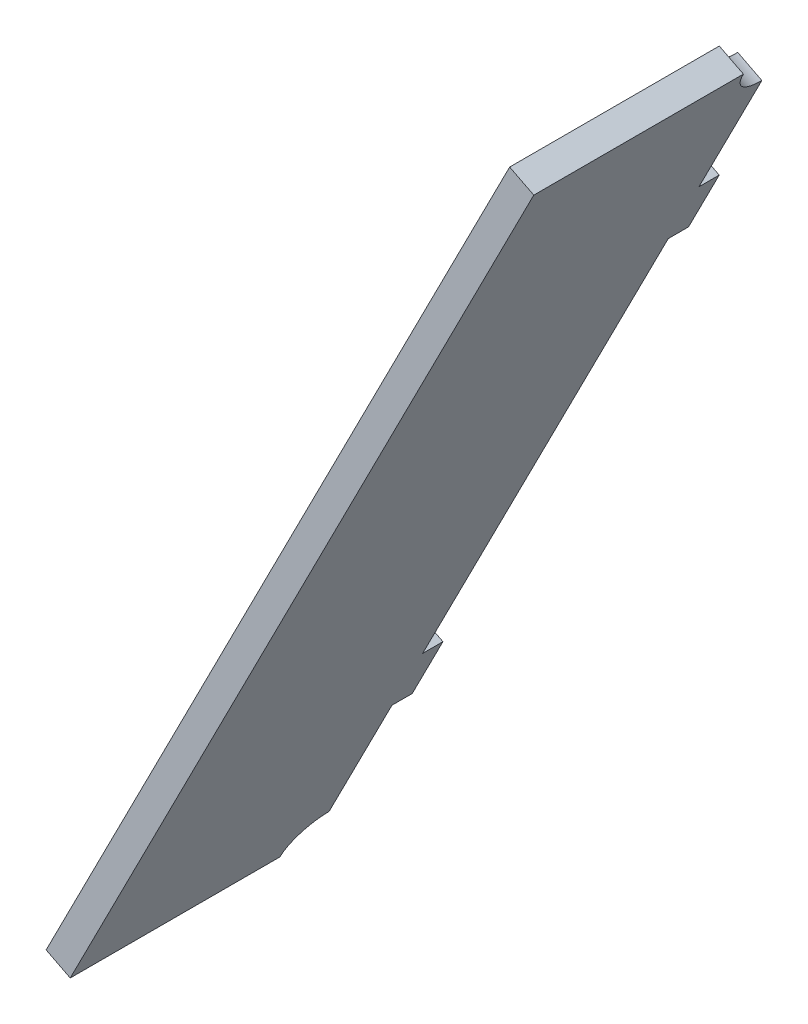
ISO-10303-21;
HEADER;
FILE_DESCRIPTION(('STEP AP214'),'2;1');
FILE_NAME('part.step','',(''),(''),'','','');
FILE_SCHEMA(('AUTOMOTIVE_DESIGN { 1 0 10303 214 1 1 1 1 }'));
ENDSEC;
DATA;
#1=APPLICATION_CONTEXT('core data for automotive mechanical design processes');
#2=APPLICATION_PROTOCOL_DEFINITION('international standard','automotive_design',2000,#1);
#3=PRODUCT_CONTEXT('',#1,'mechanical');
#4=PRODUCT('Part','Part','',(#3));
#5=PRODUCT_RELATED_PRODUCT_CATEGORY('part','',(#4));
#6=PRODUCT_DEFINITION_FORMATION('','',#4);
#7=PRODUCT_DEFINITION_CONTEXT('part definition',#1,'design');
#8=PRODUCT_DEFINITION('design','',#6,#7);
#9=PRODUCT_DEFINITION_SHAPE('','',#8);
#10=(LENGTH_UNIT() NAMED_UNIT(*) SI_UNIT(.MILLI.,.METRE.));
#11=(NAMED_UNIT(*) PLANE_ANGLE_UNIT() SI_UNIT($,.RADIAN.));
#12=(NAMED_UNIT(*) SI_UNIT($,.STERADIAN.) SOLID_ANGLE_UNIT());
#13=UNCERTAINTY_MEASURE_WITH_UNIT(LENGTH_MEASURE(1.E-05),#10,'distance_accuracy_value','');
#14=(GEOMETRIC_REPRESENTATION_CONTEXT(3) GLOBAL_UNCERTAINTY_ASSIGNED_CONTEXT((#13)) GLOBAL_UNIT_ASSIGNED_CONTEXT((#10,
#11,#12)) REPRESENTATION_CONTEXT('',''));
#15=CARTESIAN_POINT('',(0.,0.,0.));
#16=DIRECTION('',(0.,0.,1.));
#17=DIRECTION('',(1.,0.,0.));
#18=AXIS2_PLACEMENT_3D('',#15,#16,#17);
#19=CARTESIAN_POINT('',(1777.94361156912,3592.93720569683,-4.42342663159654E-11));
#20=DIRECTION('',(-0.453990499739547,-0.891006524188368,0.));
#21=DIRECTION('',(0.,0.,-1.));
#22=AXIS2_PLACEMENT_3D('',#19,#20,#21);
#23=PLANE('',#22);
#24=DIRECTION('',(-0.891006524188368,0.453990499739547,0.));
#25=VECTOR('',#24,1.);
#26=CARTESIAN_POINT('',(1777.94361156912,3592.93720569683,134.));
#27=LINE('',#26,#25);
#28=CARTESIAN_POINT('',(1781.50763766588,3591.12124369787,134.));
#29=VERTEX_POINT('',#28);
#30=CARTESIAN_POINT('',(1777.94361156912,3592.93720569683,134.));
#31=VERTEX_POINT('',#30);
#32=EDGE_CURVE('E11',#29,#31,#27,.T.);
#33=ORIENTED_EDGE('',*,*,#32,.F.);
#34=DIRECTION('',(0.,0.,1.));
#35=VECTOR('',#34,1.);
#36=CARTESIAN_POINT('',(1781.50763766588,3591.12124369787,-1.60698653736108E-13));
#37=LINE('',#36,#35);
#38=CARTESIAN_POINT('',(1781.50763766588,3591.12124369787,165.));
#39=VERTEX_POINT('',#38);
#40=EDGE_CURVE('E128',#39,#29,#37,.F.);
#41=ORIENTED_EDGE('',*,*,#40,.F.);
#42=DIRECTION('',(-0.891006524188368,0.453990499739547,0.));
#43=VECTOR('',#42,1.);
#44=CARTESIAN_POINT('',(1777.94361156912,3592.93720569683,165.));
#45=LINE('',#44,#43);
#46=CARTESIAN_POINT('',(1777.94361156912,3592.93720569683,165.));
#47=VERTEX_POINT('',#46);
#48=EDGE_CURVE('E53',#39,#47,#45,.T.);
#49=ORIENTED_EDGE('',*,*,#48,.T.);
#50=DIRECTION('',(0.,0.,-1.));
#51=VECTOR('',#50,1.);
#52=CARTESIAN_POINT('',(1777.94361156912,3592.93720569683,-4.42342663159654E-11));
#53=LINE('',#52,#51);
#54=EDGE_CURVE('E206',#47,#31,#53,.T.);
#55=ORIENTED_EDGE('',*,*,#54,.T.);
#56=EDGE_LOOP('',(#33,#41,#49,#55));
#57=FACE_BOUND('',#56,.T.);
#58=ADVANCED_FACE('F43',(#57),#23,.T.);
#59=CARTESIAN_POINT('',(-41.8773066368508,21.3375534877574,164.999999999999));
#60=DIRECTION('',(0.,0.,1.));
#61=DIRECTION('',(-0.453990499739547,-0.891006524188368,0.));
#62=AXIS2_PLACEMENT_3D('',#59,#60,#61);
#63=PLANE('',#62);
#64=ORIENTED_EDGE('',*,*,#48,.F.);
#65=DIRECTION('',(0.453990499739547,0.891006524188368,0.));
#66=VECTOR('',#65,1.);
#67=CARTESIAN_POINT('',(-38.3132805400973,19.5215914887992,165.));
#68=LINE('',#67,#66);
#69=CARTESIAN_POINT('',(1850.06020312655,3725.66322885032,165.));
#70=VERTEX_POINT('',#69);
#71=EDGE_CURVE('E165',#70,#39,#68,.F.);
#72=ORIENTED_EDGE('',*,*,#71,.F.);
#73=DIRECTION('',(-0.891006524188368,0.453990499739547,0.));
#74=VECTOR('',#73,1.);
#75=CARTESIAN_POINT('',(1846.4961770298,3727.47919084928,165.));
#76=LINE('',#75,#74);
#77=CARTESIAN_POINT('',(1846.4961770298,3727.47919084928,165.));
#78=VERTEX_POINT('',#77);
#79=EDGE_CURVE('E199',#70,#78,#76,.T.);
#80=ORIENTED_EDGE('',*,*,#79,.T.);
#81=DIRECTION('',(-0.453990499739547,-0.891006524188368,0.));
#82=VECTOR('',#81,1.);
#83=CARTESIAN_POINT('',(-41.8773066368508,21.3375534877574,164.999999999999));
#84=LINE('',#83,#82);
#85=EDGE_CURVE('E216',#78,#47,#84,.T.);
#86=ORIENTED_EDGE('',*,*,#85,.T.);
#87=EDGE_LOOP('',(#64,#72,#80,#86));
#88=FACE_BOUND('',#87,.T.);
#89=ADVANCED_FACE('F219',(#88),#63,.T.);
#90=CARTESIAN_POINT('',(1846.4961770298,3727.47919084927,-4.58939508681323E-11));
#91=DIRECTION('',(0.453990499739547,0.891006524188368,0.));
#92=DIRECTION('',(0.,0.,1.));
#93=AXIS2_PLACEMENT_3D('',#90,#91,#92);
#94=PLANE('',#93);
#95=ORIENTED_EDGE('',*,*,#79,.F.);
#96=DIRECTION('',(0.,0.,1.));
#97=VECTOR('',#96,1.);
#98=CARTESIAN_POINT('',(1850.06020312655,3725.66322885032,-1.60698653736108E-13));
#99=LINE('',#98,#97);
#100=CARTESIAN_POINT('',(1850.06020312655,3725.66322885032,134.));
#101=VERTEX_POINT('',#100);
#102=EDGE_CURVE('E162',#101,#70,#99,.T.);
#103=ORIENTED_EDGE('',*,*,#102,.F.);
#104=DIRECTION('',(-0.891006524188368,0.453990499739547,0.));
#105=VECTOR('',#104,1.);
#106=CARTESIAN_POINT('',(1846.4961770298,3727.47919084928,134.));
#107=LINE('',#106,#105);
#108=CARTESIAN_POINT('',(1846.4961770298,3727.47919084928,134.));
#109=VERTEX_POINT('',#108);
#110=EDGE_CURVE('E196',#101,#109,#107,.T.);
#111=ORIENTED_EDGE('',*,*,#110,.T.);
#112=DIRECTION('',(0.,0.,1.));
#113=VECTOR('',#112,1.);
#114=CARTESIAN_POINT('',(1846.4961770298,3727.47919084927,-4.58939508681323E-11));
#115=LINE('',#114,#113);
#116=EDGE_CURVE('E220',#109,#78,#115,.T.);
#117=ORIENTED_EDGE('',*,*,#116,.T.);
#118=EDGE_LOOP('',(#95,#103,#111,#117));
#119=FACE_BOUND('',#118,.T.);
#120=ADVANCED_FACE('F299',(#119),#94,.T.);
#121=CARTESIAN_POINT('',(1846.4961770298,3727.47919084928,129.));
#122=DIRECTION('',(0.891006524188368,-0.453990499739547,0.));
#123=DIRECTION('',(0.453990499739547,0.891006524188368,0.));
#124=AXIS2_PLACEMENT_3D('',#121,#122,#123);
#125=CYLINDRICAL_SURFACE('',#124,5.00000000000032);
#126=ORIENTED_EDGE('',*,*,#110,.F.);
#127=CARTESIAN_POINT('',(1850.06020312655,3725.66322885032,129.));
#128=DIRECTION('',(0.891006524188368,-0.453990499739547,0.));
#129=DIRECTION('',(0.453990499739547,0.891006524188368,0.));
#130=AXIS2_PLACEMENT_3D('',#127,#128,#129);
#131=CIRCLE('',#130,5.00000000000032);
#132=CARTESIAN_POINT('',(1847.79025062785,3721.20819622937,129.));
#133=VERTEX_POINT('',#132);
#134=EDGE_CURVE('E159',#133,#101,#131,.F.);
#135=ORIENTED_EDGE('',*,*,#134,.F.);
#136=DIRECTION('',(-0.891006524188368,0.453990499739547,0.));
#137=VECTOR('',#136,1.);
#138=CARTESIAN_POINT('',(1844.2262245311,3723.02415822833,129.));
#139=LINE('',#138,#137);
#140=CARTESIAN_POINT('',(1844.2262245311,3723.02415822833,129.));
#141=VERTEX_POINT('',#140);
#142=EDGE_CURVE('E191',#133,#141,#139,.T.);
#143=ORIENTED_EDGE('',*,*,#142,.T.);
#144=CARTESIAN_POINT('',(1846.4961770298,3727.47919084928,129.));
#145=DIRECTION('',(0.891006524188368,-0.453990499739547,0.));
#146=DIRECTION('',(0.453990499739547,0.891006524188368,0.));
#147=AXIS2_PLACEMENT_3D('',#144,#145,#146);
#148=CIRCLE('',#147,5.00000000000032);
#149=EDGE_CURVE('E222',#141,#109,#148,.F.);
#150=ORIENTED_EDGE('',*,*,#149,.T.);
#151=EDGE_LOOP('',(#126,#135,#143,#150));
#152=FACE_BOUND('',#151,.T.);
#153=ADVANCED_FACE('F302',(#152),#125,.F.);
#154=CARTESIAN_POINT('',(-41.8773066368506,21.3375534877573,128.999999999999));
#155=DIRECTION('',(0.,0.,-1.));
#156=DIRECTION('',(0.453990499739547,0.891006524188368,0.));
#157=AXIS2_PLACEMENT_3D('',#154,#155,#156);
#158=PLANE('',#157);
#159=ORIENTED_EDGE('',*,*,#142,.F.);
#160=DIRECTION('',(0.453990499739547,0.891006524188368,0.));
#161=VECTOR('',#160,1.);
#162=CARTESIAN_POINT('',(-38.3132805400972,19.5215914887992,129.));
#163=LINE('',#162,#161);
#164=CARTESIAN_POINT('',(1838.48344538319,3702.94256248351,129.));
#165=VERTEX_POINT('',#164);
#166=EDGE_CURVE('E156',#165,#133,#163,.T.);
#167=ORIENTED_EDGE('',*,*,#166,.F.);
#168=DIRECTION('',(-0.891006524188368,0.453990499739547,0.));
#169=VECTOR('',#168,1.);
#170=CARTESIAN_POINT('',(1834.91941928644,3704.75852448247,129.));
#171=LINE('',#170,#169);
#172=CARTESIAN_POINT('',(1834.91941928644,3704.75852448247,129.));
#173=VERTEX_POINT('',#172);
#174=EDGE_CURVE('E188',#165,#173,#171,.T.);
#175=ORIENTED_EDGE('',*,*,#174,.T.);
#176=DIRECTION('',(0.453990499739547,0.891006524188368,0.));
#177=VECTOR('',#176,1.);
#178=CARTESIAN_POINT('',(-41.8773066368506,21.3375534877573,128.999999999999));
#179=LINE('',#178,#177);
#180=EDGE_CURVE('E228',#173,#141,#179,.T.);
#181=ORIENTED_EDGE('',*,*,#180,.T.);
#182=EDGE_LOOP('',(#159,#167,#175,#181));
#183=FACE_BOUND('',#182,.T.);
#184=ADVANCED_FACE('F305',(#183),#158,.T.);
#185=CARTESIAN_POINT('',(1834.91941928644,3704.75852448247,126.));
#186=DIRECTION('',(0.453990499739547,0.891006524188368,0.));
#187=DIRECTION('',(0.,0.,1.));
#188=AXIS2_PLACEMENT_3D('',#185,#186,#187);
#189=PLANE('',#188);
#190=ORIENTED_EDGE('',*,*,#174,.F.);
#191=DIRECTION('',(0.,0.,1.));
#192=VECTOR('',#191,1.);
#193=CARTESIAN_POINT('',(1838.48344538319,3702.94256248351,-1.60698653736108E-13));
#194=LINE('',#193,#192);
#195=CARTESIAN_POINT('',(1838.48344538319,3702.94256248351,126.));
#196=VERTEX_POINT('',#195);
#197=EDGE_CURVE('E153',#196,#165,#194,.T.);
#198=ORIENTED_EDGE('',*,*,#197,.F.);
#199=DIRECTION('',(-0.891006524188368,0.453990499739547,0.));
#200=VECTOR('',#199,1.);
#201=CARTESIAN_POINT('',(1834.91941928644,3704.75852448247,126.));
#202=LINE('',#201,#200);
#203=CARTESIAN_POINT('',(1834.91941928644,3704.75852448247,126.));
#204=VERTEX_POINT('',#203);
#205=EDGE_CURVE('E185',#196,#204,#202,.T.);
#206=ORIENTED_EDGE('',*,*,#205,.T.);
#207=DIRECTION('',(0.,0.,1.));
#208=VECTOR('',#207,1.);
#209=CARTESIAN_POINT('',(1834.91941928644,3704.75852448247,126.));
#210=LINE('',#209,#208);
#211=EDGE_CURVE('E232',#204,#173,#210,.T.);
#212=ORIENTED_EDGE('',*,*,#211,.T.);
#213=EDGE_LOOP('',(#190,#198,#206,#212));
#214=FACE_BOUND('',#213,.T.);
#215=ADVANCED_FACE('F283',(#214),#189,.T.);
#216=CARTESIAN_POINT('',(1830.37951428904,3695.84845924059,126.));
#217=DIRECTION('',(0.,0.,-1.));
#218=DIRECTION('',(0.453990499739536,0.891006524188373,0.));
#219=AXIS2_PLACEMENT_3D('',#216,#217,#218);
#220=PLANE('',#219);
#221=ORIENTED_EDGE('',*,*,#205,.F.);
#222=DIRECTION('',(0.453990499739547,0.891006524188368,0.));
#223=VECTOR('',#222,1.);
#224=CARTESIAN_POINT('',(-38.3132805400972,19.5215914887992,126.));
#225=LINE('',#224,#223);
#226=CARTESIAN_POINT('',(1833.9435403858,3694.03249724163,126.));
#227=VERTEX_POINT('',#226);
#228=EDGE_CURVE('E150',#227,#196,#225,.T.);
#229=ORIENTED_EDGE('',*,*,#228,.F.);
#230=DIRECTION('',(-0.891006524188368,0.453990499739547,0.));
#231=VECTOR('',#230,1.);
#232=CARTESIAN_POINT('',(1830.37951428904,3695.84845924059,126.));
#233=LINE('',#232,#231);
#234=CARTESIAN_POINT('',(1830.37951428904,3695.84845924059,126.));
#235=VERTEX_POINT('',#234);
#236=EDGE_CURVE('E180',#227,#235,#233,.T.);
#237=ORIENTED_EDGE('',*,*,#236,.T.);
#238=DIRECTION('',(0.453990499739536,0.891006524188373,0.));
#239=VECTOR('',#238,1.);
#240=CARTESIAN_POINT('',(1830.37951428904,3695.84845924059,126.));
#241=LINE('',#240,#239);
#242=EDGE_CURVE('E273',#235,#204,#241,.T.);
#243=ORIENTED_EDGE('',*,*,#242,.T.);
#244=EDGE_LOOP('',(#221,#229,#237,#243));
#245=FACE_BOUND('',#244,.T.);
#246=ADVANCED_FACE('F308',(#245),#220,.T.);
#247=CARTESIAN_POINT('',(1830.37951428904,3695.84845924059,126.));
#248=DIRECTION('',(0.453990499739547,0.891006524188368,0.));
#249=DIRECTION('',(0.,0.,1.));
#250=AXIS2_PLACEMENT_3D('',#247,#248,#249);
#251=PLANE('',#250);
#252=ORIENTED_EDGE('',*,*,#236,.F.);
#253=DIRECTION('',(0.,0.,1.));
#254=VECTOR('',#253,1.);
#255=CARTESIAN_POINT('',(1833.9435403858,3694.03249724163,-1.60698653736108E-13));
#256=LINE('',#255,#254);
#257=CARTESIAN_POINT('',(1833.9435403858,3694.03249724163,129.));
#258=VERTEX_POINT('',#257);
#259=EDGE_CURVE('E147',#227,#258,#256,.T.);
#260=ORIENTED_EDGE('',*,*,#259,.T.);
#261=DIRECTION('',(-0.891006524188368,0.453990499739547,0.));
#262=VECTOR('',#261,1.);
#263=CARTESIAN_POINT('',(1830.37951428904,3695.84845924059,129.));
#264=LINE('',#263,#262);
#265=CARTESIAN_POINT('',(1830.37951428904,3695.84845924059,129.));
#266=VERTEX_POINT('',#265);
#267=EDGE_CURVE('E177',#258,#266,#264,.T.);
#268=ORIENTED_EDGE('',*,*,#267,.T.);
#269=DIRECTION('',(0.,0.,1.));
#270=VECTOR('',#269,1.);
#271=CARTESIAN_POINT('',(1830.37951428904,3695.84845924059,126.));
#272=LINE('',#271,#270);
#273=EDGE_CURVE('E244',#235,#266,#272,.T.);
#274=ORIENTED_EDGE('',*,*,#273,.F.);
#275=EDGE_LOOP('',(#252,#260,#268,#274));
#276=FACE_BOUND('',#275,.T.);
#277=ADVANCED_FACE('F309',(#276),#251,.F.);
#278=CARTESIAN_POINT('',(-41.8773066368506,21.3375534877573,128.999999999999));
#279=DIRECTION('',(0.,0.,-1.));
#280=DIRECTION('',(0.453990499739547,0.891006524188368,0.));
#281=AXIS2_PLACEMENT_3D('',#278,#279,#280);
#282=PLANE('',#281);
#283=ORIENTED_EDGE('',*,*,#267,.F.);
#284=DIRECTION('',(0.453990499739547,0.891006524188368,0.));
#285=VECTOR('',#284,1.);
#286=CARTESIAN_POINT('',(-38.3132805400972,19.5215914887992,129.));
#287=LINE('',#286,#285);
#288=CARTESIAN_POINT('',(1797.62430040663,3622.75197530656,129.));
#289=VERTEX_POINT('',#288);
#290=EDGE_CURVE('E144',#289,#258,#287,.T.);
#291=ORIENTED_EDGE('',*,*,#290,.F.);
#292=DIRECTION('',(-0.891006524188368,0.453990499739547,0.));
#293=VECTOR('',#292,1.);
#294=CARTESIAN_POINT('',(1794.06027430988,3624.56793730552,129.));
#295=LINE('',#294,#293);
#296=CARTESIAN_POINT('',(1794.06027430988,3624.56793730552,129.));
#297=VERTEX_POINT('',#296);
#298=EDGE_CURVE('E174',#289,#297,#295,.T.);
#299=ORIENTED_EDGE('',*,*,#298,.T.);
#300=EDGE_CURVE('E239',#297,#266,#179,.T.);
#301=ORIENTED_EDGE('',*,*,#300,.T.);
#302=EDGE_LOOP('',(#283,#291,#299,#301));
#303=FACE_BOUND('',#302,.T.);
#304=ADVANCED_FACE('F264',(#303),#282,.T.);
#305=CARTESIAN_POINT('',(1794.06027430988,3624.56793730552,126.));
#306=DIRECTION('',(0.453990499739547,0.891006524188368,0.));
#307=DIRECTION('',(0.,0.,1.));
#308=AXIS2_PLACEMENT_3D('',#305,#306,#307);
#309=PLANE('',#308);
#310=ORIENTED_EDGE('',*,*,#298,.F.);
#311=DIRECTION('',(0.,0.,1.));
#312=VECTOR('',#311,1.);
#313=CARTESIAN_POINT('',(1797.62430040663,3622.75197530656,-1.60698653736108E-13));
#314=LINE('',#313,#312);
#315=CARTESIAN_POINT('',(1797.62430040663,3622.75197530656,126.));
#316=VERTEX_POINT('',#315);
#317=EDGE_CURVE('E141',#316,#289,#314,.T.);
#318=ORIENTED_EDGE('',*,*,#317,.F.);
#319=DIRECTION('',(-0.891006524188368,0.453990499739547,0.));
#320=VECTOR('',#319,1.);
#321=CARTESIAN_POINT('',(1794.06027430988,3624.56793730552,126.));
#322=LINE('',#321,#320);
#323=CARTESIAN_POINT('',(1794.06027430988,3624.56793730552,126.));
#324=VERTEX_POINT('',#323);
#325=EDGE_CURVE('E171',#316,#324,#322,.T.);
#326=ORIENTED_EDGE('',*,*,#325,.T.);
#327=DIRECTION('',(0.,0.,1.));
#328=VECTOR('',#327,1.);
#329=CARTESIAN_POINT('',(1794.06027430988,3624.56793730552,126.));
#330=LINE('',#329,#328);
#331=EDGE_CURVE('E243',#324,#297,#330,.T.);
#332=ORIENTED_EDGE('',*,*,#331,.T.);
#333=EDGE_LOOP('',(#310,#318,#326,#332));
#334=FACE_BOUND('',#333,.T.);
#335=ADVANCED_FACE('F260',(#334),#309,.T.);
#336=CARTESIAN_POINT('',(1794.06027430988,3624.56793730552,126.));
#337=DIRECTION('',(0.,0.,-1.));
#338=DIRECTION('',(0.453990499739589,0.891006524188347,0.));
#339=AXIS2_PLACEMENT_3D('',#336,#337,#338);
#340=PLANE('',#339);
#341=ORIENTED_EDGE('',*,*,#325,.F.);
#342=DIRECTION('',(0.453990499739547,0.891006524188368,0.));
#343=VECTOR('',#342,1.);
#344=CARTESIAN_POINT('',(-38.3132805400972,19.5215914887992,126.));
#345=LINE('',#344,#343);
#346=CARTESIAN_POINT('',(1793.08439540924,3613.84191006468,126.));
#347=VERTEX_POINT('',#346);
#348=EDGE_CURVE('E138',#347,#316,#345,.T.);
#349=ORIENTED_EDGE('',*,*,#348,.F.);
#350=DIRECTION('',(-0.891006524188368,0.453990499739547,0.));
#351=VECTOR('',#350,1.);
#352=CARTESIAN_POINT('',(1789.52036931248,3615.65787206364,126.));
#353=LINE('',#352,#351);
#354=CARTESIAN_POINT('',(1789.52036931248,3615.65787206364,126.));
#355=VERTEX_POINT('',#354);
#356=EDGE_CURVE('E169',#347,#355,#353,.T.);
#357=ORIENTED_EDGE('',*,*,#356,.T.);
#358=DIRECTION('',(0.453990499739589,0.891006524188347,0.));
#359=VECTOR('',#358,1.);
#360=CARTESIAN_POINT('',(1794.06027430988,3624.56793730552,126.));
#361=LINE('',#360,#359);
#362=EDGE_CURVE('E248',#355,#324,#361,.T.);
#363=ORIENTED_EDGE('',*,*,#362,.T.);
#364=EDGE_LOOP('',(#341,#349,#357,#363));
#365=FACE_BOUND('',#364,.T.);
#366=ADVANCED_FACE('F256',(#365),#340,.T.);
#367=CARTESIAN_POINT('',(1789.52036931248,3615.65787206364,126.));
#368=DIRECTION('',(0.453990499739547,0.891006524188368,0.));
#369=DIRECTION('',(0.,0.,1.));
#370=AXIS2_PLACEMENT_3D('',#367,#368,#369);
#371=PLANE('',#370);
#372=ORIENTED_EDGE('',*,*,#356,.F.);
#373=DIRECTION('',(0.,0.,1.));
#374=VECTOR('',#373,1.);
#375=CARTESIAN_POINT('',(1793.08439540924,3613.84191006468,-1.60698653736108E-13));
#376=LINE('',#375,#374);
#377=CARTESIAN_POINT('',(1793.08439540924,3613.84191006468,129.));
#378=VERTEX_POINT('',#377);
#379=EDGE_CURVE('E135',#347,#378,#376,.T.);
#380=ORIENTED_EDGE('',*,*,#379,.T.);
#381=DIRECTION('',(-0.891006524188368,0.453990499739547,0.));
#382=VECTOR('',#381,1.);
#383=CARTESIAN_POINT('',(1789.52036931248,3615.65787206364,129.));
#384=LINE('',#383,#382);
#385=CARTESIAN_POINT('',(1789.52036931248,3615.65787206364,129.));
#386=VERTEX_POINT('',#385);
#387=EDGE_CURVE('E61',#378,#386,#384,.T.);
#388=ORIENTED_EDGE('',*,*,#387,.T.);
#389=DIRECTION('',(0.,0.,1.));
#390=VECTOR('',#389,1.);
#391=CARTESIAN_POINT('',(1789.52036931248,3615.65787206364,126.));
#392=LINE('',#391,#390);
#393=EDGE_CURVE('E121',#355,#386,#392,.T.);
#394=ORIENTED_EDGE('',*,*,#393,.F.);
#395=EDGE_LOOP('',(#372,#380,#388,#394));
#396=FACE_BOUND('',#395,.T.);
#397=ADVANCED_FACE('F254',(#396),#371,.F.);
#398=CARTESIAN_POINT('',(-41.8773066368506,21.3375534877573,128.999999999999));
#399=DIRECTION('',(0.,0.,-1.));
#400=DIRECTION('',(0.453990499739547,0.891006524188368,0.));
#401=AXIS2_PLACEMENT_3D('',#398,#399,#400);
#402=PLANE('',#401);
#403=ORIENTED_EDGE('',*,*,#387,.F.);
#404=DIRECTION('',(0.453990499739547,0.891006524188368,0.));
#405=VECTOR('',#404,1.);
#406=CARTESIAN_POINT('',(-38.3132805400972,19.5215914887992,129.));
#407=LINE('',#406,#405);
#408=CARTESIAN_POINT('',(1783.77759016457,3595.57627631881,129.));
#409=VERTEX_POINT('',#408);
#410=EDGE_CURVE('E126',#409,#378,#407,.T.);
#411=ORIENTED_EDGE('',*,*,#410,.F.);
#412=DIRECTION('',(-0.891006524188368,0.453990499739547,0.));
#413=VECTOR('',#412,1.);
#414=CARTESIAN_POINT('',(1780.21356406782,3597.39223831777,129.));
#415=LINE('',#414,#413);
#416=CARTESIAN_POINT('',(1780.21356406782,3597.39223831777,129.));
#417=VERTEX_POINT('',#416);
#418=EDGE_CURVE('E47',#409,#417,#415,.T.);
#419=ORIENTED_EDGE('',*,*,#418,.T.);
#420=EDGE_CURVE('E137',#417,#386,#179,.T.);
#421=ORIENTED_EDGE('',*,*,#420,.T.);
#422=EDGE_LOOP('',(#403,#411,#419,#421));
#423=FACE_BOUND('',#422,.T.);
#424=ADVANCED_FACE('F130',(#423),#402,.T.);
#425=CARTESIAN_POINT('',(1777.94361156912,3592.93720569683,129.));
#426=DIRECTION('',(0.891006524188368,-0.453990499739547,0.));
#427=DIRECTION('',(0.453990499739547,0.891006524188368,0.));
#428=AXIS2_PLACEMENT_3D('',#425,#426,#427);
#429=CYLINDRICAL_SURFACE('',#428,5.00000000000003);
#430=CARTESIAN_POINT('',(1781.50763766588,3591.12124369787,129.));
#431=DIRECTION('',(0.891006524188368,-0.453990499739547,0.));
#432=DIRECTION('',(0.453990499739547,0.891006524188368,0.));
#433=AXIS2_PLACEMENT_3D('',#430,#431,#432);
#434=CIRCLE('',#433,5.00000000000003);
#435=EDGE_CURVE('E115',#409,#29,#434,.T.);
#436=ORIENTED_EDGE('',*,*,#435,.T.);
#437=ORIENTED_EDGE('',*,*,#32,.T.);
#438=CARTESIAN_POINT('',(1777.94361156912,3592.93720569683,129.));
#439=DIRECTION('',(0.891006524188368,-0.453990499739547,0.));
#440=DIRECTION('',(0.453990499739547,0.891006524188368,0.));
#441=AXIS2_PLACEMENT_3D('',#438,#439,#440);
#442=CIRCLE('',#441,5.00000000000003);
#443=EDGE_CURVE('E117',#417,#31,#442,.T.);
#444=ORIENTED_EDGE('',*,*,#443,.F.);
#445=ORIENTED_EDGE('',*,*,#418,.F.);
#446=EDGE_LOOP('',(#436,#437,#444,#445));
#447=FACE_BOUND('',#446,.T.);
#448=ADVANCED_FACE('F45',(#447),#429,.F.);
#449=CARTESIAN_POINT('',(-41.8773066368502,21.3375534877571,-1.75686664568548E-13));
#450=DIRECTION('',(0.891006524188368,-0.453990499739547,0.));
#451=DIRECTION('',(0.453990499739547,0.891006524188368,0.));
#452=AXIS2_PLACEMENT_3D('',#449,#450,#451);
#453=PLANE('',#452);
#454=ORIENTED_EDGE('',*,*,#420,.F.);
#455=ORIENTED_EDGE('',*,*,#443,.T.);
#456=ORIENTED_EDGE('',*,*,#54,.F.);
#457=ORIENTED_EDGE('',*,*,#85,.F.);
#458=ORIENTED_EDGE('',*,*,#116,.F.);
#459=ORIENTED_EDGE('',*,*,#149,.F.);
#460=ORIENTED_EDGE('',*,*,#180,.F.);
#461=ORIENTED_EDGE('',*,*,#211,.F.);
#462=ORIENTED_EDGE('',*,*,#242,.F.);
#463=ORIENTED_EDGE('',*,*,#273,.T.);
#464=ORIENTED_EDGE('',*,*,#300,.F.);
#465=ORIENTED_EDGE('',*,*,#331,.F.);
#466=ORIENTED_EDGE('',*,*,#362,.F.);
#467=ORIENTED_EDGE('',*,*,#393,.T.);
#468=EDGE_LOOP('',(#454,#455,#456,#457,#458,#459,#460,#461,#462,#463,#464,#465,#466,#467));
#469=FACE_BOUND('',#468,.T.);
#470=ADVANCED_FACE('F214',(#469),#453,.F.);
#471=CARTESIAN_POINT('',(-38.3132805400967,19.521591488799,-1.60698653736108E-13));
#472=DIRECTION('',(0.891006524188368,-0.453990499739547,0.));
#473=DIRECTION('',(0.453990499739547,0.891006524188368,0.));
#474=AXIS2_PLACEMENT_3D('',#471,#472,#473);
#475=PLANE('',#474);
#476=ORIENTED_EDGE('',*,*,#410,.T.);
#477=ORIENTED_EDGE('',*,*,#379,.F.);
#478=ORIENTED_EDGE('',*,*,#348,.T.);
#479=ORIENTED_EDGE('',*,*,#317,.T.);
#480=ORIENTED_EDGE('',*,*,#290,.T.);
#481=ORIENTED_EDGE('',*,*,#259,.F.);
#482=ORIENTED_EDGE('',*,*,#228,.T.);
#483=ORIENTED_EDGE('',*,*,#197,.T.);
#484=ORIENTED_EDGE('',*,*,#166,.T.);
#485=ORIENTED_EDGE('',*,*,#134,.T.);
#486=ORIENTED_EDGE('',*,*,#102,.T.);
#487=ORIENTED_EDGE('',*,*,#71,.T.);
#488=ORIENTED_EDGE('',*,*,#40,.T.);
#489=ORIENTED_EDGE('',*,*,#435,.F.);
#490=EDGE_LOOP('',(#476,#477,#478,#479,#480,#481,#482,#483,#484,#485,#486,#487,#488,#489));
#491=FACE_BOUND('',#490,.T.);
#492=ADVANCED_FACE('F124',(#491),#475,.T.);
#493=CLOSED_SHELL('',(#58,#89,#120,#153,#184,#215,#246,#277,#304,#335,#366,#397,#424,#448,#470,#492));
#494=MANIFOLD_SOLID_BREP('B2',#493);
#495=ADVANCED_BREP_SHAPE_REPRESENTATION('',(#18,#494),#14);
#496=SHAPE_DEFINITION_REPRESENTATION(#9,#495);
ENDSEC;
END-ISO-10303-21;
